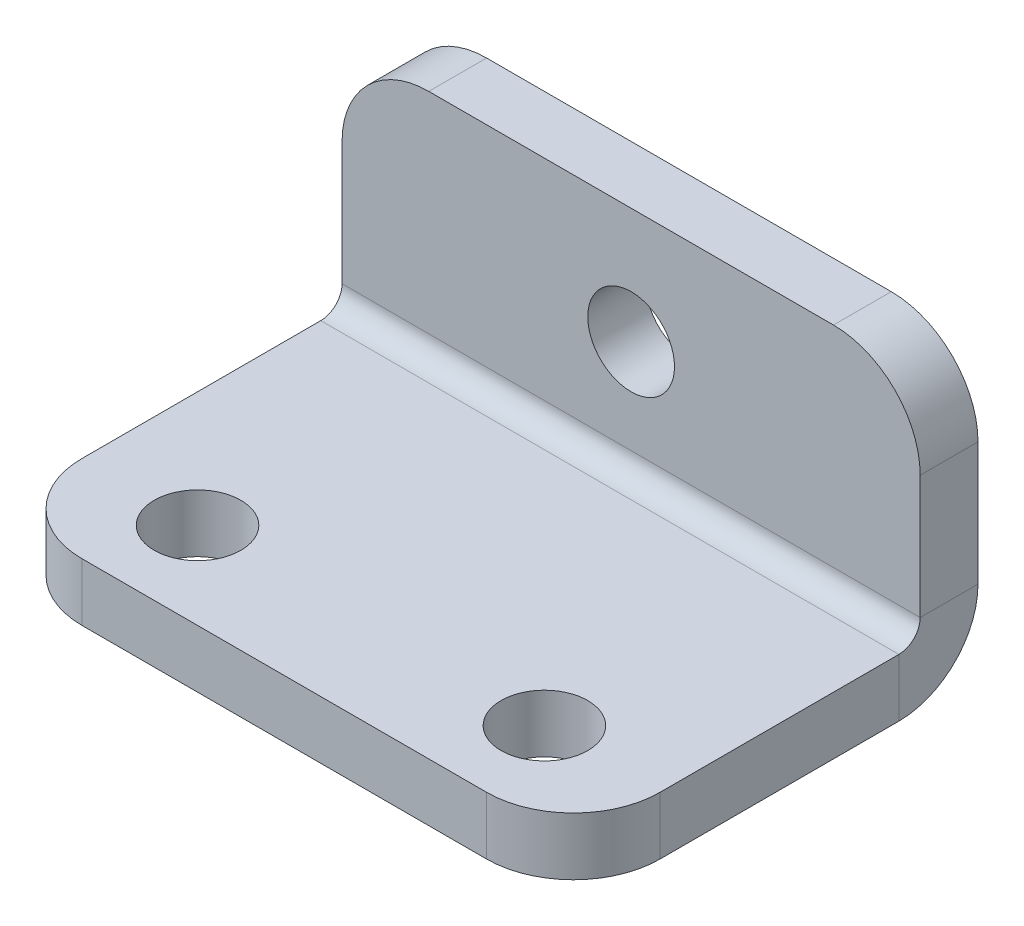
ISO-10303-21;
HEADER;
FILE_DESCRIPTION(('STEP AP214'),'2;1');
FILE_NAME('part.step','',(''),(''),'','','');
FILE_SCHEMA(('AUTOMOTIVE_DESIGN { 1 0 10303 214 1 1 1 1 }'));
ENDSEC;
DATA;
#1=APPLICATION_CONTEXT('core data for automotive mechanical design processes');
#2=APPLICATION_PROTOCOL_DEFINITION('international standard','automotive_design',2000,#1);
#3=PRODUCT_CONTEXT('',#1,'mechanical');
#4=PRODUCT('Part','Part','',(#3));
#5=PRODUCT_RELATED_PRODUCT_CATEGORY('part','',(#4));
#6=PRODUCT_DEFINITION_FORMATION('','',#4);
#7=PRODUCT_DEFINITION_CONTEXT('part definition',#1,'design');
#8=PRODUCT_DEFINITION('design','',#6,#7);
#9=PRODUCT_DEFINITION_SHAPE('','',#8);
#10=(LENGTH_UNIT() NAMED_UNIT(*) SI_UNIT(.MILLI.,.METRE.));
#11=(NAMED_UNIT(*) PLANE_ANGLE_UNIT() SI_UNIT($,.RADIAN.));
#12=(NAMED_UNIT(*) SI_UNIT($,.STERADIAN.) SOLID_ANGLE_UNIT());
#13=UNCERTAINTY_MEASURE_WITH_UNIT(LENGTH_MEASURE(1.E-05),#10,'distance_accuracy_value','');
#14=(GEOMETRIC_REPRESENTATION_CONTEXT(3) GLOBAL_UNCERTAINTY_ASSIGNED_CONTEXT((#13)) GLOBAL_UNIT_ASSIGNED_CONTEXT((#10,
#11,#12)) REPRESENTATION_CONTEXT('',''));
#15=CARTESIAN_POINT('',(0.,0.,0.));
#16=DIRECTION('',(0.,0.,1.));
#17=DIRECTION('',(1.,0.,0.));
#18=AXIS2_PLACEMENT_3D('',#15,#16,#17);
#19=CARTESIAN_POINT('',(10.,0.7366,-12.));
#20=DIRECTION('',(1.,0.,0.));
#21=DIRECTION('',(0.,0.,-1.));
#22=AXIS2_PLACEMENT_3D('',#19,#20,#21);
#23=PLANE('',#22);
#24=DIRECTION('',(0.,0.,-1.));
#25=VECTOR('',#24,1.);
#26=CARTESIAN_POINT('',(10.,0.7366,-12.));
#27=LINE('',#26,#25);
#28=CARTESIAN_POINT('',(10.,0.7366,-12.));
#29=VERTEX_POINT('',#28);
#30=CARTESIAN_POINT('',(10.,0.7366,-14.));
#31=VERTEX_POINT('',#30);
#32=EDGE_CURVE('E126',#29,#31,#27,.T.);
#33=ORIENTED_EDGE('',*,*,#32,.F.);
#34=CARTESIAN_POINT('',(10.,0.7366,-11.2634));
#35=DIRECTION('',(-1.,0.,0.));
#36=DIRECTION('',(0.,0.,1.));
#37=AXIS2_PLACEMENT_3D('',#34,#35,#36);
#38=CIRCLE('',#37,0.7366);
#39=CARTESIAN_POINT('',(10.,0.,-11.2634));
#40=VERTEX_POINT('',#39);
#41=EDGE_CURVE('E130',#40,#29,#38,.F.);
#42=ORIENTED_EDGE('',*,*,#41,.F.);
#43=DIRECTION('',(0.,1.,0.));
#44=VECTOR('',#43,1.);
#45=CARTESIAN_POINT('',(10.,-2.,-11.2634));
#46=LINE('',#45,#44);
#47=CARTESIAN_POINT('',(10.,-2.,-11.2634));
#48=VERTEX_POINT('',#47);
#49=EDGE_CURVE('E138',#48,#40,#46,.T.);
#50=ORIENTED_EDGE('',*,*,#49,.F.);
#51=CARTESIAN_POINT('',(10.,0.7366,-11.2634));
#52=DIRECTION('',(1.,0.,0.));
#53=DIRECTION('',(0.,0.,-1.));
#54=AXIS2_PLACEMENT_3D('',#51,#52,#53);
#55=CIRCLE('',#54,2.7366);
#56=EDGE_CURVE('E132',#48,#31,#55,.T.);
#57=ORIENTED_EDGE('',*,*,#56,.T.);
#58=EDGE_LOOP('',(#33,#42,#50,#57));
#59=FACE_BOUND('',#58,.T.);
#60=ADVANCED_FACE('F36',(#59),#23,.T.);
#61=CARTESIAN_POINT('',(10.,-2.,-11.2634));
#62=DIRECTION('',(1.,0.,0.));
#63=DIRECTION('',(0.,0.,-1.));
#64=AXIS2_PLACEMENT_3D('',#61,#62,#63);
#65=PLANE('',#64);
#66=DIRECTION('',(0.,1.,0.));
#67=VECTOR('',#66,1.);
#68=CARTESIAN_POINT('',(10.,0.,-14.));
#69=LINE('',#68,#67);
#70=CARTESIAN_POINT('',(10.,5.,-14.));
#71=VERTEX_POINT('',#70);
#72=EDGE_CURVE('E159',#31,#71,#69,.T.);
#73=ORIENTED_EDGE('',*,*,#72,.T.);
#74=DIRECTION('',(0.,0.,-1.));
#75=VECTOR('',#74,1.);
#76=CARTESIAN_POINT('',(10.,5.,-11.2634));
#77=LINE('',#76,#75);
#78=CARTESIAN_POINT('',(10.,5.,-12.));
#79=VERTEX_POINT('',#78);
#80=EDGE_CURVE('E11',#71,#79,#77,.F.);
#81=ORIENTED_EDGE('',*,*,#80,.T.);
#82=DIRECTION('',(0.,1.,0.));
#83=VECTOR('',#82,1.);
#84=CARTESIAN_POINT('',(10.,0.,-12.));
#85=LINE('',#84,#83);
#86=EDGE_CURVE('E147',#29,#79,#85,.T.);
#87=ORIENTED_EDGE('',*,*,#86,.F.);
#88=ORIENTED_EDGE('',*,*,#32,.T.);
#89=EDGE_LOOP('',(#73,#81,#87,#88));
#90=FACE_BOUND('',#89,.T.);
#91=ADVANCED_FACE('F157',(#90),#65,.T.);
#92=CARTESIAN_POINT('',(-10.,0.,-11.2634));
#93=DIRECTION('',(-1.,0.,0.));
#94=DIRECTION('',(0.,0.,1.));
#95=AXIS2_PLACEMENT_3D('',#92,#93,#94);
#96=PLANE('',#95);
#97=DIRECTION('',(0.,-1.,0.));
#98=VECTOR('',#97,1.);
#99=CARTESIAN_POINT('',(-10.,0.,-11.2634));
#100=LINE('',#99,#98);
#101=CARTESIAN_POINT('',(-10.,0.,-11.2634));
#102=VERTEX_POINT('',#101);
#103=CARTESIAN_POINT('',(-10.,-2.,-11.2634));
#104=VERTEX_POINT('',#103);
#105=EDGE_CURVE('E203',#102,#104,#100,.T.);
#106=ORIENTED_EDGE('',*,*,#105,.F.);
#107=CARTESIAN_POINT('',(-10.,0.7366,-11.2634));
#108=DIRECTION('',(-1.,0.,0.));
#109=DIRECTION('',(0.,0.,1.));
#110=AXIS2_PLACEMENT_3D('',#107,#108,#109);
#111=CIRCLE('',#110,0.7366);
#112=CARTESIAN_POINT('',(-10.,0.7366,-12.));
#113=VERTEX_POINT('',#112);
#114=EDGE_CURVE('E178',#102,#113,#111,.F.);
#115=ORIENTED_EDGE('',*,*,#114,.T.);
#116=DIRECTION('',(0.,0.,1.));
#117=VECTOR('',#116,1.);
#118=CARTESIAN_POINT('',(-10.,0.7366,-14.));
#119=LINE('',#118,#117);
#120=CARTESIAN_POINT('',(-10.,0.7366,-14.));
#121=VERTEX_POINT('',#120);
#122=EDGE_CURVE('E201',#121,#113,#119,.T.);
#123=ORIENTED_EDGE('',*,*,#122,.F.);
#124=CARTESIAN_POINT('',(-10.,0.7366,-11.2634));
#125=DIRECTION('',(1.,0.,0.));
#126=DIRECTION('',(0.,0.,-1.));
#127=AXIS2_PLACEMENT_3D('',#124,#125,#126);
#128=CIRCLE('',#127,2.7366);
#129=EDGE_CURVE('E184',#104,#121,#128,.T.);
#130=ORIENTED_EDGE('',*,*,#129,.F.);
#131=EDGE_LOOP('',(#106,#115,#123,#130));
#132=FACE_BOUND('',#131,.T.);
#133=ADVANCED_FACE('F296',(#132),#96,.T.);
#134=CARTESIAN_POINT('',(-10.,0.7366,-14.));
#135=DIRECTION('',(-1.,0.,0.));
#136=DIRECTION('',(0.,0.,1.));
#137=AXIS2_PLACEMENT_3D('',#134,#135,#136);
#138=PLANE('',#137);
#139=DIRECTION('',(0.,0.,-1.));
#140=VECTOR('',#139,1.);
#141=CARTESIAN_POINT('',(-10.,-2.,0.));
#142=LINE('',#141,#140);
#143=CARTESIAN_POINT('',(-10.,-2.,-3.));
#144=VERTEX_POINT('',#143);
#145=EDGE_CURVE('E182',#144,#104,#142,.T.);
#146=ORIENTED_EDGE('',*,*,#145,.F.);
#147=DIRECTION('',(0.,1.,0.));
#148=VECTOR('',#147,1.);
#149=CARTESIAN_POINT('',(-10.,0.7366,-3.));
#150=LINE('',#149,#148);
#151=CARTESIAN_POINT('',(-10.,0.,-3.));
#152=VERTEX_POINT('',#151);
#153=EDGE_CURVE('E223',#144,#152,#150,.T.);
#154=ORIENTED_EDGE('',*,*,#153,.T.);
#155=DIRECTION('',(0.,0.,-1.));
#156=VECTOR('',#155,1.);
#157=CARTESIAN_POINT('',(-10.,0.,0.));
#158=LINE('',#157,#156);
#159=EDGE_CURVE('E180',#152,#102,#158,.T.);
#160=ORIENTED_EDGE('',*,*,#159,.T.);
#161=ORIENTED_EDGE('',*,*,#105,.T.);
#162=EDGE_LOOP('',(#146,#154,#160,#161));
#163=FACE_BOUND('',#162,.T.);
#164=ADVANCED_FACE('F245',(#163),#138,.T.);
#165=CARTESIAN_POINT('',(10.,0.,-14.));
#166=DIRECTION('',(0.,0.,1.));
#167=DIRECTION('',(1.,0.,0.));
#168=AXIS2_PLACEMENT_3D('',#165,#166,#167);
#169=PLANE('',#168);
#170=CARTESIAN_POINT('',(0.,4.,-14.));
#171=DIRECTION('',(0.,0.,-1.));
#172=DIRECTION('',(-1.,0.,0.));
#173=AXIS2_PLACEMENT_3D('',#170,#171,#172);
#174=CIRCLE('',#173,1.5);
#175=CARTESIAN_POINT('',(-1.5,4.,-14.));
#176=VERTEX_POINT('',#175);
#177=EDGE_CURVE('E278',#176,#176,#174,.T.);
#178=ORIENTED_EDGE('',*,*,#177,.F.);
#179=EDGE_LOOP('',(#178));
#180=FACE_BOUND('',#179,.T.);
#181=DIRECTION('',(0.,1.,0.));
#182=VECTOR('',#181,1.);
#183=CARTESIAN_POINT('',(-10.,0.,-14.));
#184=LINE('',#183,#182);
#185=CARTESIAN_POINT('',(-10.,5.,-14.));
#186=VERTEX_POINT('',#185);
#187=EDGE_CURVE('E173',#121,#186,#184,.T.);
#188=ORIENTED_EDGE('',*,*,#187,.T.);
#189=CARTESIAN_POINT('',(-7.,5.,-14.));
#190=DIRECTION('',(0.,0.,1.));
#191=DIRECTION('',(1.,0.,0.));
#192=AXIS2_PLACEMENT_3D('',#189,#190,#191);
#193=CIRCLE('',#192,3.);
#194=CARTESIAN_POINT('',(-7.,8.,-14.));
#195=VERTEX_POINT('',#194);
#196=EDGE_CURVE('E212',#186,#195,#193,.F.);
#197=ORIENTED_EDGE('',*,*,#196,.T.);
#198=DIRECTION('',(-1.,0.,0.));
#199=VECTOR('',#198,1.);
#200=CARTESIAN_POINT('',(10.,8.,-14.));
#201=LINE('',#200,#199);
#202=CARTESIAN_POINT('',(7.,8.,-14.));
#203=VERTEX_POINT('',#202);
#204=EDGE_CURVE('E198',#203,#195,#201,.T.);
#205=ORIENTED_EDGE('',*,*,#204,.F.);
#206=CARTESIAN_POINT('',(7.,5.,-14.));
#207=DIRECTION('',(0.,0.,1.));
#208=DIRECTION('',(1.,0.,0.));
#209=AXIS2_PLACEMENT_3D('',#206,#207,#208);
#210=CIRCLE('',#209,3.);
#211=EDGE_CURVE('E210',#203,#71,#210,.F.);
#212=ORIENTED_EDGE('',*,*,#211,.T.);
#213=ORIENTED_EDGE('',*,*,#72,.F.);
#214=DIRECTION('',(-1.,0.,0.));
#215=VECTOR('',#214,1.);
#216=CARTESIAN_POINT('',(10.,0.7366,-14.));
#217=LINE('',#216,#215);
#218=EDGE_CURVE('E172',#31,#121,#217,.T.);
#219=ORIENTED_EDGE('',*,*,#218,.T.);
#220=EDGE_LOOP('',(#188,#197,#205,#212,#213,#219));
#221=FACE_BOUND('',#220,.T.);
#222=ADVANCED_FACE('F264',(#180,#221),#169,.F.);
#223=CARTESIAN_POINT('',(10.,8.,-12.));
#224=DIRECTION('',(0.,1.,0.));
#225=DIRECTION('',(0.,0.,1.));
#226=AXIS2_PLACEMENT_3D('',#223,#224,#225);
#227=PLANE('',#226);
#228=ORIENTED_EDGE('',*,*,#204,.T.);
#229=DIRECTION('',(0.,0.,-1.));
#230=VECTOR('',#229,1.);
#231=CARTESIAN_POINT('',(-7.,8.,-12.));
#232=LINE('',#231,#230);
#233=CARTESIAN_POINT('',(-7.,8.,-12.));
#234=VERTEX_POINT('',#233);
#235=EDGE_CURVE('E217',#195,#234,#232,.F.);
#236=ORIENTED_EDGE('',*,*,#235,.T.);
#237=DIRECTION('',(-1.,0.,0.));
#238=VECTOR('',#237,1.);
#239=CARTESIAN_POINT('',(10.,8.,-12.));
#240=LINE('',#239,#238);
#241=CARTESIAN_POINT('',(7.,8.,-12.));
#242=VERTEX_POINT('',#241);
#243=EDGE_CURVE('E154',#242,#234,#240,.T.);
#244=ORIENTED_EDGE('',*,*,#243,.F.);
#245=DIRECTION('',(0.,0.,-1.));
#246=VECTOR('',#245,1.);
#247=CARTESIAN_POINT('',(7.,8.,-12.));
#248=LINE('',#247,#246);
#249=EDGE_CURVE('E214',#242,#203,#248,.T.);
#250=ORIENTED_EDGE('',*,*,#249,.T.);
#251=EDGE_LOOP('',(#228,#236,#244,#250));
#252=FACE_BOUND('',#251,.T.);
#253=ADVANCED_FACE('F288',(#252),#227,.T.);
#254=CARTESIAN_POINT('',(10.,0.,-12.));
#255=DIRECTION('',(0.,0.,1.));
#256=DIRECTION('',(1.,0.,0.));
#257=AXIS2_PLACEMENT_3D('',#254,#255,#256);
#258=PLANE('',#257);
#259=CARTESIAN_POINT('',(0.,4.,-12.));
#260=DIRECTION('',(0.,0.,1.));
#261=DIRECTION('',(1.,0.,0.));
#262=AXIS2_PLACEMENT_3D('',#259,#260,#261);
#263=CIRCLE('',#262,1.5);
#264=CARTESIAN_POINT('',(1.5,4.,-12.));
#265=VERTEX_POINT('',#264);
#266=EDGE_CURVE('E279',#265,#265,#263,.F.);
#267=ORIENTED_EDGE('',*,*,#266,.T.);
#268=EDGE_LOOP('',(#267));
#269=FACE_BOUND('',#268,.T.);
#270=ORIENTED_EDGE('',*,*,#243,.T.);
#271=CARTESIAN_POINT('',(-7.,5.,-12.));
#272=DIRECTION('',(0.,0.,1.));
#273=DIRECTION('',(1.,0.,0.));
#274=AXIS2_PLACEMENT_3D('',#271,#272,#273);
#275=CIRCLE('',#274,3.);
#276=CARTESIAN_POINT('',(-10.,5.,-12.));
#277=VERTEX_POINT('',#276);
#278=EDGE_CURVE('E221',#234,#277,#275,.T.);
#279=ORIENTED_EDGE('',*,*,#278,.T.);
#280=DIRECTION('',(0.,1.,0.));
#281=VECTOR('',#280,1.);
#282=CARTESIAN_POINT('',(-10.,0.,-12.));
#283=LINE('',#282,#281);
#284=EDGE_CURVE('E150',#113,#277,#283,.T.);
#285=ORIENTED_EDGE('',*,*,#284,.F.);
#286=DIRECTION('',(-1.,0.,0.));
#287=VECTOR('',#286,1.);
#288=CARTESIAN_POINT('',(10.,0.7366,-12.));
#289=LINE('',#288,#287);
#290=EDGE_CURVE('E144',#29,#113,#289,.T.);
#291=ORIENTED_EDGE('',*,*,#290,.F.);
#292=ORIENTED_EDGE('',*,*,#86,.T.);
#293=CARTESIAN_POINT('',(7.,5.,-12.));
#294=DIRECTION('',(0.,0.,1.));
#295=DIRECTION('',(1.,0.,0.));
#296=AXIS2_PLACEMENT_3D('',#293,#294,#295);
#297=CIRCLE('',#296,3.);
#298=EDGE_CURVE('E219',#79,#242,#297,.T.);
#299=ORIENTED_EDGE('',*,*,#298,.T.);
#300=EDGE_LOOP('',(#270,#279,#285,#291,#292,#299));
#301=FACE_BOUND('',#300,.T.);
#302=ADVANCED_FACE('F146',(#269,#301),#258,.T.);
#303=CARTESIAN_POINT('',(10.,0.7366,-11.2634));
#304=DIRECTION('',(-1.,0.,0.));
#305=DIRECTION('',(0.,0.,1.));
#306=AXIS2_PLACEMENT_3D('',#303,#304,#305);
#307=CYLINDRICAL_SURFACE('',#306,0.7366);
#308=ORIENTED_EDGE('',*,*,#114,.F.);
#309=DIRECTION('',(-1.,0.,0.));
#310=VECTOR('',#309,1.);
#311=CARTESIAN_POINT('',(10.,0.,-11.2634));
#312=LINE('',#311,#310);
#313=EDGE_CURVE('E155',#40,#102,#312,.T.);
#314=ORIENTED_EDGE('',*,*,#313,.F.);
#315=ORIENTED_EDGE('',*,*,#41,.T.);
#316=ORIENTED_EDGE('',*,*,#290,.T.);
#317=EDGE_LOOP('',(#308,#314,#315,#316));
#318=FACE_BOUND('',#317,.T.);
#319=ADVANCED_FACE('F162',(#318),#307,.F.);
#320=CARTESIAN_POINT('',(10.,0.,0.));
#321=DIRECTION('',(0.,1.,0.));
#322=DIRECTION('',(0.,0.,1.));
#323=AXIS2_PLACEMENT_3D('',#320,#321,#322);
#324=PLANE('',#323);
#325=CARTESIAN_POINT('',(6.,0.,-3.));
#326=DIRECTION('',(0.,1.,0.));
#327=DIRECTION('',(0.,0.,1.));
#328=AXIS2_PLACEMENT_3D('',#325,#326,#327);
#329=CIRCLE('',#328,1.5);
#330=CARTESIAN_POINT('',(6.,0.,-1.5));
#331=VERTEX_POINT('',#330);
#332=EDGE_CURVE('E275',#331,#331,#329,.T.);
#333=ORIENTED_EDGE('',*,*,#332,.F.);
#334=EDGE_LOOP('',(#333));
#335=FACE_BOUND('',#334,.T.);
#336=CARTESIAN_POINT('',(-6.,0.,-3.));
#337=DIRECTION('',(0.,1.,0.));
#338=DIRECTION('',(0.,0.,1.));
#339=AXIS2_PLACEMENT_3D('',#336,#337,#338);
#340=CIRCLE('',#339,1.5);
#341=CARTESIAN_POINT('',(-6.,0.,-1.5));
#342=VERTEX_POINT('',#341);
#343=EDGE_CURVE('E269',#342,#342,#340,.T.);
#344=ORIENTED_EDGE('',*,*,#343,.F.);
#345=EDGE_LOOP('',(#344));
#346=FACE_BOUND('',#345,.T.);
#347=ORIENTED_EDGE('',*,*,#159,.F.);
#348=CARTESIAN_POINT('',(-7.,0.,-3.));
#349=DIRECTION('',(0.,1.,0.));
#350=DIRECTION('',(0.,0.,1.));
#351=AXIS2_PLACEMENT_3D('',#348,#349,#350);
#352=CIRCLE('',#351,3.);
#353=CARTESIAN_POINT('',(-7.,0.,0.));
#354=VERTEX_POINT('',#353);
#355=EDGE_CURVE('E228',#152,#354,#352,.T.);
#356=ORIENTED_EDGE('',*,*,#355,.T.);
#357=DIRECTION('',(-1.,0.,0.));
#358=VECTOR('',#357,1.);
#359=CARTESIAN_POINT('',(10.,0.,0.));
#360=LINE('',#359,#358);
#361=CARTESIAN_POINT('',(7.,0.,0.));
#362=VERTEX_POINT('',#361);
#363=EDGE_CURVE('E194',#362,#354,#360,.T.);
#364=ORIENTED_EDGE('',*,*,#363,.F.);
#365=CARTESIAN_POINT('',(7.,0.,-3.));
#366=DIRECTION('',(0.,1.,0.));
#367=DIRECTION('',(0.,0.,1.));
#368=AXIS2_PLACEMENT_3D('',#365,#366,#367);
#369=CIRCLE('',#368,3.);
#370=CARTESIAN_POINT('',(10.,0.,-3.));
#371=VERTEX_POINT('',#370);
#372=EDGE_CURVE('E226',#362,#371,#369,.T.);
#373=ORIENTED_EDGE('',*,*,#372,.T.);
#374=DIRECTION('',(0.,0.,-1.));
#375=VECTOR('',#374,1.);
#376=CARTESIAN_POINT('',(10.,0.,0.));
#377=LINE('',#376,#375);
#378=EDGE_CURVE('E164',#371,#40,#377,.T.);
#379=ORIENTED_EDGE('',*,*,#378,.T.);
#380=ORIENTED_EDGE('',*,*,#313,.T.);
#381=EDGE_LOOP('',(#347,#356,#364,#373,#379,#380));
#382=FACE_BOUND('',#381,.T.);
#383=ADVANCED_FACE('F251',(#335,#346,#382),#324,.T.);
#384=CARTESIAN_POINT('',(10.,-2.,0.));
#385=DIRECTION('',(0.,0.,1.));
#386=DIRECTION('',(1.,0.,0.));
#387=AXIS2_PLACEMENT_3D('',#384,#385,#386);
#388=PLANE('',#387);
#389=ORIENTED_EDGE('',*,*,#363,.T.);
#390=DIRECTION('',(0.,1.,0.));
#391=VECTOR('',#390,1.);
#392=CARTESIAN_POINT('',(-7.,-2.,0.));
#393=LINE('',#392,#391);
#394=CARTESIAN_POINT('',(-7.,-2.,0.));
#395=VERTEX_POINT('',#394);
#396=EDGE_CURVE('E58',#354,#395,#393,.F.);
#397=ORIENTED_EDGE('',*,*,#396,.T.);
#398=DIRECTION('',(-1.,0.,0.));
#399=VECTOR('',#398,1.);
#400=CARTESIAN_POINT('',(10.,-2.,0.));
#401=LINE('',#400,#399);
#402=CARTESIAN_POINT('',(7.,-2.,0.));
#403=VERTEX_POINT('',#402);
#404=EDGE_CURVE('E192',#403,#395,#401,.T.);
#405=ORIENTED_EDGE('',*,*,#404,.F.);
#406=DIRECTION('',(0.,1.,0.));
#407=VECTOR('',#406,1.);
#408=CARTESIAN_POINT('',(7.,0.,0.));
#409=LINE('',#408,#407);
#410=EDGE_CURVE('E230',#403,#362,#409,.T.);
#411=ORIENTED_EDGE('',*,*,#410,.T.);
#412=EDGE_LOOP('',(#389,#397,#405,#411));
#413=FACE_BOUND('',#412,.T.);
#414=ADVANCED_FACE('F252',(#413),#388,.T.);
#415=CARTESIAN_POINT('',(10.,-2.,0.));
#416=DIRECTION('',(0.,1.,0.));
#417=DIRECTION('',(0.,0.,1.));
#418=AXIS2_PLACEMENT_3D('',#415,#416,#417);
#419=PLANE('',#418);
#420=CARTESIAN_POINT('',(6.,-2.,-3.));
#421=DIRECTION('',(0.,1.,0.));
#422=DIRECTION('',(0.,0.,1.));
#423=AXIS2_PLACEMENT_3D('',#420,#421,#422);
#424=CIRCLE('',#423,1.5);
#425=CARTESIAN_POINT('',(6.,-2.,-1.5));
#426=VERTEX_POINT('',#425);
#427=EDGE_CURVE('E272',#426,#426,#424,.F.);
#428=ORIENTED_EDGE('',*,*,#427,.F.);
#429=EDGE_LOOP('',(#428));
#430=FACE_BOUND('',#429,.T.);
#431=CARTESIAN_POINT('',(-6.,-2.,-3.));
#432=DIRECTION('',(0.,1.,0.));
#433=DIRECTION('',(0.,0.,1.));
#434=AXIS2_PLACEMENT_3D('',#431,#432,#433);
#435=CIRCLE('',#434,1.5);
#436=CARTESIAN_POINT('',(-6.,-2.,-1.5));
#437=VERTEX_POINT('',#436);
#438=EDGE_CURVE('E176',#437,#437,#435,.F.);
#439=ORIENTED_EDGE('',*,*,#438,.F.);
#440=EDGE_LOOP('',(#439));
#441=FACE_BOUND('',#440,.T.);
#442=ORIENTED_EDGE('',*,*,#404,.T.);
#443=CARTESIAN_POINT('',(-7.,-2.,-3.));
#444=DIRECTION('',(0.,1.,0.));
#445=DIRECTION('',(0.,0.,1.));
#446=AXIS2_PLACEMENT_3D('',#443,#444,#445);
#447=CIRCLE('',#446,3.);
#448=EDGE_CURVE('E236',#395,#144,#447,.F.);
#449=ORIENTED_EDGE('',*,*,#448,.T.);
#450=ORIENTED_EDGE('',*,*,#145,.T.);
#451=DIRECTION('',(-1.,0.,0.));
#452=VECTOR('',#451,1.);
#453=CARTESIAN_POINT('',(10.,-2.,-11.2634));
#454=LINE('',#453,#452);
#455=EDGE_CURVE('E189',#48,#104,#454,.T.);
#456=ORIENTED_EDGE('',*,*,#455,.F.);
#457=DIRECTION('',(0.,0.,-1.));
#458=VECTOR('',#457,1.);
#459=CARTESIAN_POINT('',(10.,-2.,0.));
#460=LINE('',#459,#458);
#461=CARTESIAN_POINT('',(10.,-2.,-3.));
#462=VERTEX_POINT('',#461);
#463=EDGE_CURVE('E166',#462,#48,#460,.T.);
#464=ORIENTED_EDGE('',*,*,#463,.F.);
#465=CARTESIAN_POINT('',(7.,-2.,-3.));
#466=DIRECTION('',(0.,1.,0.));
#467=DIRECTION('',(0.,0.,1.));
#468=AXIS2_PLACEMENT_3D('',#465,#466,#467);
#469=CIRCLE('',#468,3.);
#470=EDGE_CURVE('E234',#462,#403,#469,.F.);
#471=ORIENTED_EDGE('',*,*,#470,.T.);
#472=EDGE_LOOP('',(#442,#449,#450,#456,#464,#471));
#473=FACE_BOUND('',#472,.T.);
#474=ADVANCED_FACE('F240',(#430,#441,#473),#419,.F.);
#475=CARTESIAN_POINT('',(10.,0.7366,-11.2634));
#476=DIRECTION('',(-1.,0.,0.));
#477=DIRECTION('',(0.,0.,1.));
#478=AXIS2_PLACEMENT_3D('',#475,#476,#477);
#479=CYLINDRICAL_SURFACE('',#478,2.7366);
#480=ORIENTED_EDGE('',*,*,#129,.T.);
#481=ORIENTED_EDGE('',*,*,#218,.F.);
#482=ORIENTED_EDGE('',*,*,#56,.F.);
#483=ORIENTED_EDGE('',*,*,#455,.T.);
#484=EDGE_LOOP('',(#480,#481,#482,#483));
#485=FACE_BOUND('',#484,.T.);
#486=ADVANCED_FACE('F260',(#485),#479,.T.);
#487=CARTESIAN_POINT('',(10.,0.7366,-11.2634));
#488=DIRECTION('',(-1.,0.,0.));
#489=DIRECTION('',(0.,0.,1.));
#490=AXIS2_PLACEMENT_3D('',#487,#488,#489);
#491=PLANE('',#490);
#492=ORIENTED_EDGE('',*,*,#378,.F.);
#493=DIRECTION('',(0.,1.,0.));
#494=VECTOR('',#493,1.);
#495=CARTESIAN_POINT('',(10.,-2.,-3.));
#496=LINE('',#495,#494);
#497=EDGE_CURVE('E44',#371,#462,#496,.F.);
#498=ORIENTED_EDGE('',*,*,#497,.T.);
#499=ORIENTED_EDGE('',*,*,#463,.T.);
#500=ORIENTED_EDGE('',*,*,#49,.T.);
#501=EDGE_LOOP('',(#492,#498,#499,#500));
#502=FACE_BOUND('',#501,.T.);
#503=ADVANCED_FACE('F257',(#502),#491,.F.);
#504=CARTESIAN_POINT('',(-10.,0.7366,-11.2634));
#505=DIRECTION('',(-1.,0.,0.));
#506=DIRECTION('',(0.,0.,1.));
#507=AXIS2_PLACEMENT_3D('',#504,#505,#506);
#508=PLANE('',#507);
#509=ORIENTED_EDGE('',*,*,#284,.T.);
#510=DIRECTION('',(0.,0.,-1.));
#511=VECTOR('',#510,1.);
#512=CARTESIAN_POINT('',(-10.,5.,-11.2634));
#513=LINE('',#512,#511);
#514=EDGE_CURVE('E137',#277,#186,#513,.T.);
#515=ORIENTED_EDGE('',*,*,#514,.T.);
#516=ORIENTED_EDGE('',*,*,#187,.F.);
#517=ORIENTED_EDGE('',*,*,#122,.T.);
#518=EDGE_LOOP('',(#509,#515,#516,#517));
#519=FACE_BOUND('',#518,.T.);
#520=ADVANCED_FACE('F309',(#519),#508,.T.);
#521=CARTESIAN_POINT('',(-7.,5.,-11.2634));
#522=DIRECTION('',(0.,0.,-1.));
#523=DIRECTION('',(-1.,0.,0.));
#524=AXIS2_PLACEMENT_3D('',#521,#522,#523);
#525=CYLINDRICAL_SURFACE('',#524,3.);
#526=ORIENTED_EDGE('',*,*,#278,.F.);
#527=ORIENTED_EDGE('',*,*,#235,.F.);
#528=ORIENTED_EDGE('',*,*,#196,.F.);
#529=ORIENTED_EDGE('',*,*,#514,.F.);
#530=EDGE_LOOP('',(#526,#527,#528,#529));
#531=FACE_BOUND('',#530,.T.);
#532=ADVANCED_FACE('F306',(#531),#525,.T.);
#533=CARTESIAN_POINT('',(-7.,0.7366,-3.));
#534=DIRECTION('',(0.,1.,0.));
#535=DIRECTION('',(0.,0.,1.));
#536=AXIS2_PLACEMENT_3D('',#533,#534,#535);
#537=CYLINDRICAL_SURFACE('',#536,3.);
#538=ORIENTED_EDGE('',*,*,#448,.F.);
#539=ORIENTED_EDGE('',*,*,#396,.F.);
#540=ORIENTED_EDGE('',*,*,#355,.F.);
#541=ORIENTED_EDGE('',*,*,#153,.F.);
#542=EDGE_LOOP('',(#538,#539,#540,#541));
#543=FACE_BOUND('',#542,.T.);
#544=ADVANCED_FACE('F248',(#543),#537,.T.);
#545=CARTESIAN_POINT('',(7.,-2.,-3.));
#546=DIRECTION('',(0.,-1.,0.));
#547=DIRECTION('',(0.,0.,-1.));
#548=AXIS2_PLACEMENT_3D('',#545,#546,#547);
#549=CYLINDRICAL_SURFACE('',#548,3.);
#550=ORIENTED_EDGE('',*,*,#470,.F.);
#551=ORIENTED_EDGE('',*,*,#497,.F.);
#552=ORIENTED_EDGE('',*,*,#372,.F.);
#553=ORIENTED_EDGE('',*,*,#410,.F.);
#554=EDGE_LOOP('',(#550,#551,#552,#553));
#555=FACE_BOUND('',#554,.T.);
#556=ADVANCED_FACE('F256',(#555),#549,.T.);
#557=CARTESIAN_POINT('',(7.,5.,-12.));
#558=DIRECTION('',(0.,0.,-1.));
#559=DIRECTION('',(-1.,0.,0.));
#560=AXIS2_PLACEMENT_3D('',#557,#558,#559);
#561=CYLINDRICAL_SURFACE('',#560,3.);
#562=ORIENTED_EDGE('',*,*,#298,.F.);
#563=ORIENTED_EDGE('',*,*,#80,.F.);
#564=ORIENTED_EDGE('',*,*,#211,.F.);
#565=ORIENTED_EDGE('',*,*,#249,.F.);
#566=EDGE_LOOP('',(#562,#563,#564,#565));
#567=FACE_BOUND('',#566,.T.);
#568=ADVANCED_FACE('F38',(#567),#561,.T.);
#569=CARTESIAN_POINT('',(-6.,-2.001,-3.));
#570=DIRECTION('',(0.,1.,0.));
#571=DIRECTION('',(0.,0.,1.));
#572=AXIS2_PLACEMENT_3D('',#569,#570,#571);
#573=CYLINDRICAL_SURFACE('',#572,1.5);
#574=ORIENTED_EDGE('',*,*,#343,.T.);
#575=EDGE_LOOP('',(#574));
#576=FACE_BOUND('',#575,.T.);
#577=ORIENTED_EDGE('',*,*,#438,.T.);
#578=EDGE_LOOP('',(#577));
#579=FACE_BOUND('',#578,.T.);
#580=ADVANCED_FACE('F316',(#576,#579),#573,.F.);
#581=CARTESIAN_POINT('',(6.,-2.001,-3.));
#582=DIRECTION('',(0.,1.,0.));
#583=DIRECTION('',(0.,0.,1.));
#584=AXIS2_PLACEMENT_3D('',#581,#582,#583);
#585=CYLINDRICAL_SURFACE('',#584,1.5);
#586=ORIENTED_EDGE('',*,*,#332,.T.);
#587=EDGE_LOOP('',(#586));
#588=FACE_BOUND('',#587,.T.);
#589=ORIENTED_EDGE('',*,*,#427,.T.);
#590=EDGE_LOOP('',(#589));
#591=FACE_BOUND('',#590,.T.);
#592=ADVANCED_FACE('F321',(#588,#591),#585,.F.);
#593=CARTESIAN_POINT('',(0.,4.,0.000999999999999265));
#594=DIRECTION('',(0.,0.,-1.));
#595=DIRECTION('',(-1.,0.,0.));
#596=AXIS2_PLACEMENT_3D('',#593,#594,#595);
#597=CYLINDRICAL_SURFACE('',#596,1.5);
#598=ORIENTED_EDGE('',*,*,#266,.F.);
#599=EDGE_LOOP('',(#598));
#600=FACE_BOUND('',#599,.T.);
#601=ORIENTED_EDGE('',*,*,#177,.T.);
#602=EDGE_LOOP('',(#601));
#603=FACE_BOUND('',#602,.T.);
#604=ADVANCED_FACE('F285',(#600,#603),#597,.F.);
#605=CLOSED_SHELL('',(#60,#91,#133,#164,#222,#253,#302,#319,#383,#414,#474,#486,#503,#520,#532,
#544,#556,#568,#580,#592,#604));
#606=MANIFOLD_SOLID_BREP('B2',#605);
#607=ADVANCED_BREP_SHAPE_REPRESENTATION('',(#18,#606),#14);
#608=SHAPE_DEFINITION_REPRESENTATION(#9,#607);
ENDSEC;
END-ISO-10303-21;
